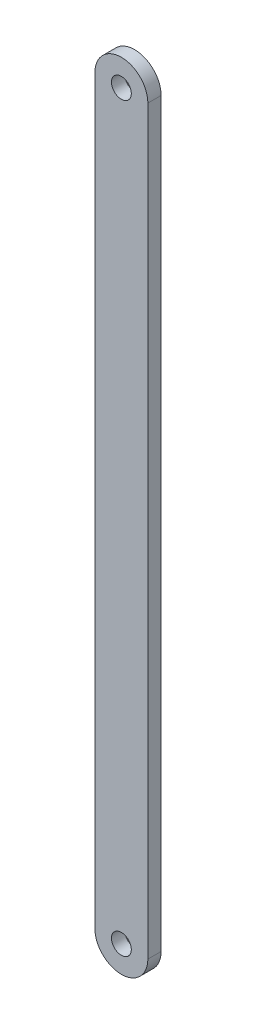
ISO-10303-21;
HEADER;
FILE_DESCRIPTION(('STEP AP214'),'2;1');
FILE_NAME('part.step','',(''),(''),'','','');
FILE_SCHEMA(('AUTOMOTIVE_DESIGN { 1 0 10303 214 1 1 1 1 }'));
ENDSEC;
DATA;
#1=APPLICATION_CONTEXT('core data for automotive mechanical design processes');
#2=APPLICATION_PROTOCOL_DEFINITION('international standard','automotive_design',2000,#1);
#3=PRODUCT_CONTEXT('',#1,'mechanical');
#4=PRODUCT('Part','Part','',(#3));
#5=PRODUCT_RELATED_PRODUCT_CATEGORY('part','',(#4));
#6=PRODUCT_DEFINITION_FORMATION('','',#4);
#7=PRODUCT_DEFINITION_CONTEXT('part definition',#1,'design');
#8=PRODUCT_DEFINITION('design','',#6,#7);
#9=PRODUCT_DEFINITION_SHAPE('','',#8);
#10=(LENGTH_UNIT() NAMED_UNIT(*) SI_UNIT(.MILLI.,.METRE.));
#11=(NAMED_UNIT(*) PLANE_ANGLE_UNIT() SI_UNIT($,.RADIAN.));
#12=(NAMED_UNIT(*) SI_UNIT($,.STERADIAN.) SOLID_ANGLE_UNIT());
#13=UNCERTAINTY_MEASURE_WITH_UNIT(LENGTH_MEASURE(1.E-05),#10,'distance_accuracy_value','');
#14=(GEOMETRIC_REPRESENTATION_CONTEXT(3) GLOBAL_UNCERTAINTY_ASSIGNED_CONTEXT((#13)) GLOBAL_UNIT_ASSIGNED_CONTEXT((#10,
#11,#12)) REPRESENTATION_CONTEXT('',''));
#15=CARTESIAN_POINT('',(0.,0.,0.));
#16=DIRECTION('',(0.,0.,1.));
#17=DIRECTION('',(1.,0.,0.));
#18=AXIS2_PLACEMENT_3D('',#15,#16,#17);
#19=CARTESIAN_POINT('',(0.,-15.5,2.));
#20=DIRECTION('',(0.,0.,1.));
#21=DIRECTION('',(1.,0.,0.));
#22=AXIS2_PLACEMENT_3D('',#19,#20,#21);
#23=PLANE('',#22);
#24=CARTESIAN_POINT('',(0.,96.5,2.));
#25=DIRECTION('',(0.,0.,1.));
#26=DIRECTION('',(1.,0.,0.));
#27=AXIS2_PLACEMENT_3D('',#24,#25,#26);
#28=CIRCLE('',#27,1.5);
#29=CARTESIAN_POINT('',(1.5,96.5,2.));
#30=VERTEX_POINT('',#29);
#31=EDGE_CURVE('E101',#30,#30,#28,.T.);
#32=ORIENTED_EDGE('',*,*,#31,.F.);
#33=EDGE_LOOP('',(#32));
#34=FACE_BOUND('',#33,.T.);
#35=CARTESIAN_POINT('',(0.,-15.5,2.));
#36=DIRECTION('',(0.,0.,1.));
#37=DIRECTION('',(1.,0.,0.));
#38=AXIS2_PLACEMENT_3D('',#35,#36,#37);
#39=CIRCLE('',#38,4.);
#40=CARTESIAN_POINT('',(-3.99999999999999,-15.5,2.));
#41=VERTEX_POINT('',#40);
#42=CARTESIAN_POINT('',(4.00000000000001,-15.5,2.));
#43=VERTEX_POINT('',#42);
#44=EDGE_CURVE('E86',#41,#43,#39,.T.);
#45=ORIENTED_EDGE('',*,*,#44,.T.);
#46=DIRECTION('',(0.,1.,0.));
#47=VECTOR('',#46,1.);
#48=CARTESIAN_POINT('',(4.,96.5,2.));
#49=LINE('',#48,#47);
#50=CARTESIAN_POINT('',(4.,96.5,2.));
#51=VERTEX_POINT('',#50);
#52=EDGE_CURVE('E81',#43,#51,#49,.T.);
#53=ORIENTED_EDGE('',*,*,#52,.T.);
#54=CARTESIAN_POINT('',(0.,96.5,2.));
#55=DIRECTION('',(0.,0.,1.));
#56=DIRECTION('',(1.,0.,0.));
#57=AXIS2_PLACEMENT_3D('',#54,#55,#56);
#58=CIRCLE('',#57,4.);
#59=CARTESIAN_POINT('',(-4.,96.5,2.));
#60=VERTEX_POINT('',#59);
#61=EDGE_CURVE('E84',#51,#60,#58,.T.);
#62=ORIENTED_EDGE('',*,*,#61,.T.);
#63=DIRECTION('',(0.,-1.,0.));
#64=VECTOR('',#63,1.);
#65=CARTESIAN_POINT('',(-4.,96.5,2.));
#66=LINE('',#65,#64);
#67=EDGE_CURVE('E51',#60,#41,#66,.T.);
#68=ORIENTED_EDGE('',*,*,#67,.T.);
#69=EDGE_LOOP('',(#45,#53,#62,#68));
#70=FACE_BOUND('',#69,.T.);
#71=CARTESIAN_POINT('',(0.,-15.5,2.));
#72=DIRECTION('',(0.,0.,1.));
#73=DIRECTION('',(1.,0.,0.));
#74=AXIS2_PLACEMENT_3D('',#71,#72,#73);
#75=CIRCLE('',#74,1.5);
#76=CARTESIAN_POINT('',(1.50000000000001,-15.5,2.));
#77=VERTEX_POINT('',#76);
#78=EDGE_CURVE('E116',#77,#77,#75,.T.);
#79=ORIENTED_EDGE('',*,*,#78,.F.);
#80=EDGE_LOOP('',(#79));
#81=FACE_BOUND('',#80,.T.);
#82=ADVANCED_FACE('F34',(#34,#70,#81),#23,.T.);
#83=CARTESIAN_POINT('',(0.,-15.5,0.));
#84=DIRECTION('',(0.,0.,1.));
#85=DIRECTION('',(1.,0.,0.));
#86=AXIS2_PLACEMENT_3D('',#83,#84,#85);
#87=PLANE('',#86);
#88=CARTESIAN_POINT('',(0.,96.5,0.));
#89=DIRECTION('',(0.,0.,1.));
#90=DIRECTION('',(1.,0.,0.));
#91=AXIS2_PLACEMENT_3D('',#88,#89,#90);
#92=CIRCLE('',#91,1.5);
#93=CARTESIAN_POINT('',(1.5,96.5,0.));
#94=VERTEX_POINT('',#93);
#95=EDGE_CURVE('E113',#94,#94,#92,.T.);
#96=ORIENTED_EDGE('',*,*,#95,.T.);
#97=EDGE_LOOP('',(#96));
#98=FACE_BOUND('',#97,.T.);
#99=CARTESIAN_POINT('',(0.,-15.5,0.));
#100=DIRECTION('',(0.,0.,1.));
#101=DIRECTION('',(1.,0.,0.));
#102=AXIS2_PLACEMENT_3D('',#99,#100,#101);
#103=CIRCLE('',#102,4.);
#104=CARTESIAN_POINT('',(-3.99999999999999,-15.5,0.));
#105=VERTEX_POINT('',#104);
#106=CARTESIAN_POINT('',(4.00000000000001,-15.5,0.));
#107=VERTEX_POINT('',#106);
#108=EDGE_CURVE('E98',#105,#107,#103,.T.);
#109=ORIENTED_EDGE('',*,*,#108,.F.);
#110=DIRECTION('',(0.,-1.,0.));
#111=VECTOR('',#110,1.);
#112=CARTESIAN_POINT('',(-4.,96.5,0.));
#113=LINE('',#112,#111);
#114=CARTESIAN_POINT('',(-4.,96.5,0.));
#115=VERTEX_POINT('',#114);
#116=EDGE_CURVE('E74',#115,#105,#113,.T.);
#117=ORIENTED_EDGE('',*,*,#116,.F.);
#118=CARTESIAN_POINT('',(0.,96.5,0.));
#119=DIRECTION('',(0.,0.,1.));
#120=DIRECTION('',(1.,0.,0.));
#121=AXIS2_PLACEMENT_3D('',#118,#119,#120);
#122=CIRCLE('',#121,4.);
#123=CARTESIAN_POINT('',(4.,96.5,0.));
#124=VERTEX_POINT('',#123);
#125=EDGE_CURVE('E68',#124,#115,#122,.T.);
#126=ORIENTED_EDGE('',*,*,#125,.F.);
#127=DIRECTION('',(0.,1.,0.));
#128=VECTOR('',#127,1.);
#129=CARTESIAN_POINT('',(4.,96.5,0.));
#130=LINE('',#129,#128);
#131=EDGE_CURVE('E90',#107,#124,#130,.T.);
#132=ORIENTED_EDGE('',*,*,#131,.F.);
#133=EDGE_LOOP('',(#109,#117,#126,#132));
#134=FACE_BOUND('',#133,.T.);
#135=CARTESIAN_POINT('',(0.,-15.5,0.));
#136=DIRECTION('',(0.,0.,1.));
#137=DIRECTION('',(1.,0.,0.));
#138=AXIS2_PLACEMENT_3D('',#135,#136,#137);
#139=CIRCLE('',#138,1.5);
#140=CARTESIAN_POINT('',(1.50000000000001,-15.5,0.));
#141=VERTEX_POINT('',#140);
#142=EDGE_CURVE('E119',#141,#141,#139,.T.);
#143=ORIENTED_EDGE('',*,*,#142,.T.);
#144=EDGE_LOOP('',(#143));
#145=FACE_BOUND('',#144,.T.);
#146=ADVANCED_FACE('F109',(#98,#134,#145),#87,.F.);
#147=CARTESIAN_POINT('',(0.,-15.5,2.));
#148=DIRECTION('',(0.,0.,-1.));
#149=DIRECTION('',(-1.,0.,0.));
#150=AXIS2_PLACEMENT_3D('',#147,#148,#149);
#151=CYLINDRICAL_SURFACE('',#150,4.);
#152=ORIENTED_EDGE('',*,*,#108,.T.);
#153=DIRECTION('',(0.,0.,-1.));
#154=VECTOR('',#153,1.);
#155=CARTESIAN_POINT('',(4.00000000000001,-15.5,2.));
#156=LINE('',#155,#154);
#157=EDGE_CURVE('E11',#43,#107,#156,.T.);
#158=ORIENTED_EDGE('',*,*,#157,.F.);
#159=ORIENTED_EDGE('',*,*,#44,.F.);
#160=DIRECTION('',(0.,0.,-1.));
#161=VECTOR('',#160,1.);
#162=CARTESIAN_POINT('',(-3.99999999999999,-15.5,2.));
#163=LINE('',#162,#161);
#164=EDGE_CURVE('E94',#41,#105,#163,.T.);
#165=ORIENTED_EDGE('',*,*,#164,.T.);
#166=EDGE_LOOP('',(#152,#158,#159,#165));
#167=FACE_BOUND('',#166,.T.);
#168=ADVANCED_FACE('F36',(#167),#151,.T.);
#169=CARTESIAN_POINT('',(4.,96.5,2.));
#170=DIRECTION('',(-1.,0.,0.));
#171=DIRECTION('',(0.,-1.,0.));
#172=AXIS2_PLACEMENT_3D('',#169,#170,#171);
#173=PLANE('',#172);
#174=ORIENTED_EDGE('',*,*,#131,.T.);
#175=DIRECTION('',(0.,0.,-1.));
#176=VECTOR('',#175,1.);
#177=CARTESIAN_POINT('',(4.,96.5,2.));
#178=LINE('',#177,#176);
#179=EDGE_CURVE('E43',#51,#124,#178,.T.);
#180=ORIENTED_EDGE('',*,*,#179,.F.);
#181=ORIENTED_EDGE('',*,*,#52,.F.);
#182=ORIENTED_EDGE('',*,*,#157,.T.);
#183=EDGE_LOOP('',(#174,#180,#181,#182));
#184=FACE_BOUND('',#183,.T.);
#185=ADVANCED_FACE('F89',(#184),#173,.F.);
#186=CARTESIAN_POINT('',(0.,96.5,2.));
#187=DIRECTION('',(0.,0.,-1.));
#188=DIRECTION('',(-1.,0.,0.));
#189=AXIS2_PLACEMENT_3D('',#186,#187,#188);
#190=CYLINDRICAL_SURFACE('',#189,4.);
#191=ORIENTED_EDGE('',*,*,#125,.T.);
#192=DIRECTION('',(0.,0.,-1.));
#193=VECTOR('',#192,1.);
#194=CARTESIAN_POINT('',(-4.,96.5,2.));
#195=LINE('',#194,#193);
#196=EDGE_CURVE('E91',#60,#115,#195,.T.);
#197=ORIENTED_EDGE('',*,*,#196,.F.);
#198=ORIENTED_EDGE('',*,*,#61,.F.);
#199=ORIENTED_EDGE('',*,*,#179,.T.);
#200=EDGE_LOOP('',(#191,#197,#198,#199));
#201=FACE_BOUND('',#200,.T.);
#202=ADVANCED_FACE('F92',(#201),#190,.T.);
#203=CARTESIAN_POINT('',(-4.,96.5,2.));
#204=DIRECTION('',(1.,0.,0.));
#205=DIRECTION('',(0.,1.,0.));
#206=AXIS2_PLACEMENT_3D('',#203,#204,#205);
#207=PLANE('',#206);
#208=ORIENTED_EDGE('',*,*,#116,.T.);
#209=ORIENTED_EDGE('',*,*,#164,.F.);
#210=ORIENTED_EDGE('',*,*,#67,.F.);
#211=ORIENTED_EDGE('',*,*,#196,.T.);
#212=EDGE_LOOP('',(#208,#209,#210,#211));
#213=FACE_BOUND('',#212,.T.);
#214=ADVANCED_FACE('F106',(#213),#207,.F.);
#215=CARTESIAN_POINT('',(0.,96.5,2.));
#216=DIRECTION('',(0.,0.,-1.));
#217=DIRECTION('',(-1.,0.,0.));
#218=AXIS2_PLACEMENT_3D('',#215,#216,#217);
#219=CYLINDRICAL_SURFACE('',#218,1.5);
#220=ORIENTED_EDGE('',*,*,#31,.T.);
#221=EDGE_LOOP('',(#220));
#222=FACE_BOUND('',#221,.T.);
#223=ORIENTED_EDGE('',*,*,#95,.F.);
#224=EDGE_LOOP('',(#223));
#225=FACE_BOUND('',#224,.T.);
#226=ADVANCED_FACE('F137',(#222,#225),#219,.F.);
#227=CARTESIAN_POINT('',(0.,-15.5,2.));
#228=DIRECTION('',(0.,0.,-1.));
#229=DIRECTION('',(-1.,0.,0.));
#230=AXIS2_PLACEMENT_3D('',#227,#228,#229);
#231=CYLINDRICAL_SURFACE('',#230,1.5);
#232=ORIENTED_EDGE('',*,*,#78,.T.);
#233=EDGE_LOOP('',(#232));
#234=FACE_BOUND('',#233,.T.);
#235=ORIENTED_EDGE('',*,*,#142,.F.);
#236=EDGE_LOOP('',(#235));
#237=FACE_BOUND('',#236,.T.);
#238=ADVANCED_FACE('F125',(#234,#237),#231,.F.);
#239=CLOSED_SHELL('',(#82,#146,#168,#185,#202,#214,#226,#238));
#240=MANIFOLD_SOLID_BREP('B2',#239);
#241=ADVANCED_BREP_SHAPE_REPRESENTATION('',(#18,#240),#14);
#242=SHAPE_DEFINITION_REPRESENTATION(#9,#241);
ENDSEC;
END-ISO-10303-21;
